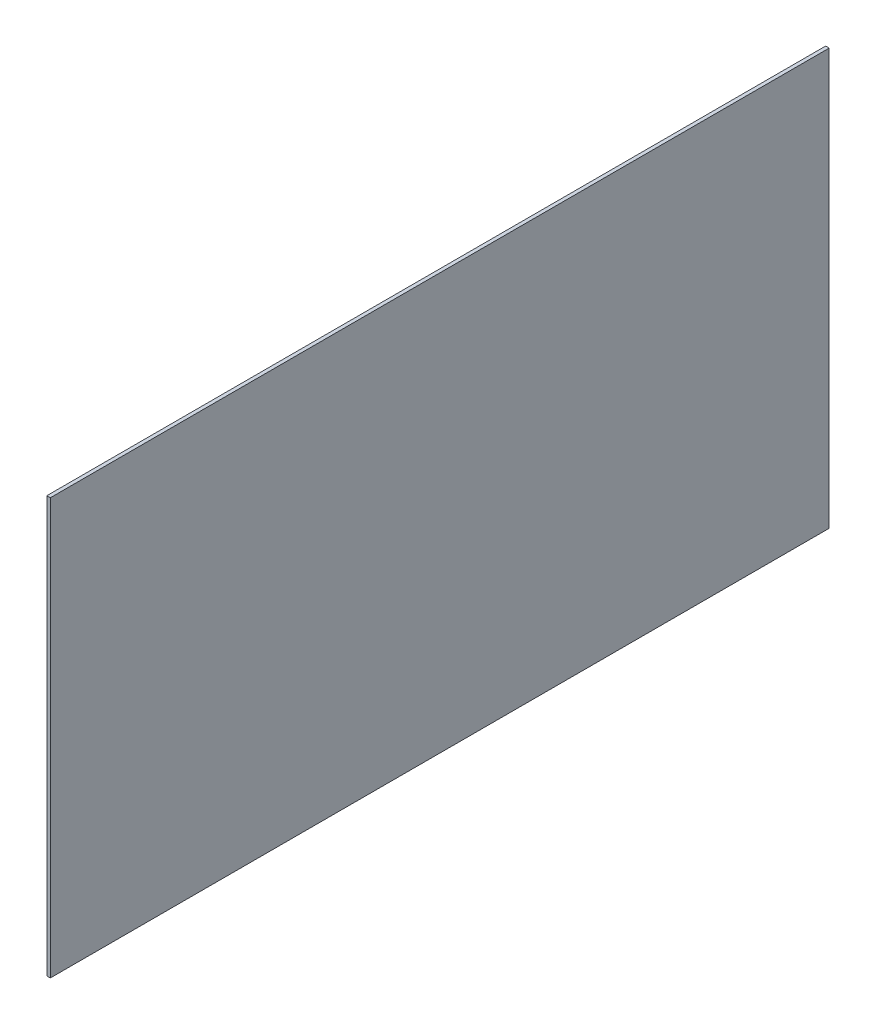
ISO-10303-21;
HEADER;
FILE_DESCRIPTION(('STEP AP214'),'2;1');
FILE_NAME('part.step','',(''),(''),'','','');
FILE_SCHEMA(('AUTOMOTIVE_DESIGN { 1 0 10303 214 1 1 1 1 }'));
ENDSEC;
DATA;
#1=APPLICATION_CONTEXT('core data for automotive mechanical design processes');
#2=APPLICATION_PROTOCOL_DEFINITION('international standard','automotive_design',2000,#1);
#3=PRODUCT_CONTEXT('',#1,'mechanical');
#4=PRODUCT('Part','Part','',(#3));
#5=PRODUCT_RELATED_PRODUCT_CATEGORY('part','',(#4));
#6=PRODUCT_DEFINITION_FORMATION('','',#4);
#7=PRODUCT_DEFINITION_CONTEXT('part definition',#1,'design');
#8=PRODUCT_DEFINITION('design','',#6,#7);
#9=PRODUCT_DEFINITION_SHAPE('','',#8);
#10=(LENGTH_UNIT() NAMED_UNIT(*) SI_UNIT(.MILLI.,.METRE.));
#11=(NAMED_UNIT(*) PLANE_ANGLE_UNIT() SI_UNIT($,.RADIAN.));
#12=(NAMED_UNIT(*) SI_UNIT($,.STERADIAN.) SOLID_ANGLE_UNIT());
#13=UNCERTAINTY_MEASURE_WITH_UNIT(LENGTH_MEASURE(1.E-05),#10,'distance_accuracy_value','');
#14=(GEOMETRIC_REPRESENTATION_CONTEXT(3) GLOBAL_UNCERTAINTY_ASSIGNED_CONTEXT((#13)) GLOBAL_UNIT_ASSIGNED_CONTEXT((#10,
#11,#12)) REPRESENTATION_CONTEXT('',''));
#15=CARTESIAN_POINT('',(0.,0.,0.));
#16=DIRECTION('',(0.,0.,1.));
#17=DIRECTION('',(1.,0.,0.));
#18=AXIS2_PLACEMENT_3D('',#15,#16,#17);
#19=CARTESIAN_POINT('',(-417.425,992.1,165.1));
#20=DIRECTION('',(-1.,0.,0.));
#21=DIRECTION('',(0.,0.,1.));
#22=AXIS2_PLACEMENT_3D('',#19,#20,#21);
#23=PLANE('',#22);
#24=DIRECTION('',(0.,1.,0.));
#25=VECTOR('',#24,1.);
#26=CARTESIAN_POINT('',(-417.425,992.1,-165.1));
#27=LINE('',#26,#25);
#28=CARTESIAN_POINT('',(-417.425,992.1,-165.1));
#29=VERTEX_POINT('',#28);
#30=CARTESIAN_POINT('',(-417.425,1168.4,-165.1));
#31=VERTEX_POINT('',#30);
#32=EDGE_CURVE('E98',#29,#31,#27,.T.);
#33=ORIENTED_EDGE('',*,*,#32,.T.);
#34=DIRECTION('',(0.,0.,-1.));
#35=VECTOR('',#34,1.);
#36=CARTESIAN_POINT('',(-417.425,1168.4,165.1));
#37=LINE('',#36,#35);
#38=CARTESIAN_POINT('',(-417.425,1168.4,165.1));
#39=VERTEX_POINT('',#38);
#40=EDGE_CURVE('E11',#39,#31,#37,.T.);
#41=ORIENTED_EDGE('',*,*,#40,.F.);
#42=DIRECTION('',(0.,1.,0.));
#43=VECTOR('',#42,1.);
#44=CARTESIAN_POINT('',(-417.425,992.1,165.1));
#45=LINE('',#44,#43);
#46=CARTESIAN_POINT('',(-417.425,992.1,165.1));
#47=VERTEX_POINT('',#46);
#48=EDGE_CURVE('E75',#47,#39,#45,.T.);
#49=ORIENTED_EDGE('',*,*,#48,.F.);
#50=DIRECTION('',(0.,0.,-1.));
#51=VECTOR('',#50,1.);
#52=CARTESIAN_POINT('',(-417.425,992.1,165.1));
#53=LINE('',#52,#51);
#54=EDGE_CURVE('E51',#47,#29,#53,.T.);
#55=ORIENTED_EDGE('',*,*,#54,.T.);
#56=EDGE_LOOP('',(#33,#41,#49,#55));
#57=FACE_BOUND('',#56,.T.);
#58=ADVANCED_FACE('F35',(#57),#23,.F.);
#59=CARTESIAN_POINT('',(-418.925,1168.4,165.1));
#60=DIRECTION('',(0.,1.,0.));
#61=DIRECTION('',(0.,0.,1.));
#62=AXIS2_PLACEMENT_3D('',#59,#60,#61);
#63=PLANE('',#62);
#64=DIRECTION('',(1.,0.,0.));
#65=VECTOR('',#64,1.);
#66=CARTESIAN_POINT('',(-418.925,1168.4,-165.1));
#67=LINE('',#66,#65);
#68=CARTESIAN_POINT('',(-418.925,1168.4,-165.1));
#69=VERTEX_POINT('',#68);
#70=EDGE_CURVE('E84',#69,#31,#67,.T.);
#71=ORIENTED_EDGE('',*,*,#70,.F.);
#72=DIRECTION('',(0.,0.,-1.));
#73=VECTOR('',#72,1.);
#74=CARTESIAN_POINT('',(-418.925,1168.4,165.1));
#75=LINE('',#74,#73);
#76=CARTESIAN_POINT('',(-418.925,1168.4,165.1));
#77=VERTEX_POINT('',#76);
#78=EDGE_CURVE('E43',#77,#69,#75,.T.);
#79=ORIENTED_EDGE('',*,*,#78,.F.);
#80=DIRECTION('',(1.,0.,0.));
#81=VECTOR('',#80,1.);
#82=CARTESIAN_POINT('',(-418.925,1168.4,165.1));
#83=LINE('',#82,#81);
#84=EDGE_CURVE('E82',#77,#39,#83,.T.);
#85=ORIENTED_EDGE('',*,*,#84,.T.);
#86=ORIENTED_EDGE('',*,*,#40,.T.);
#87=EDGE_LOOP('',(#71,#79,#85,#86));
#88=FACE_BOUND('',#87,.T.);
#89=ADVANCED_FACE('F81',(#88),#63,.T.);
#90=CARTESIAN_POINT('',(-418.925,992.1,165.1));
#91=DIRECTION('',(-1.,0.,0.));
#92=DIRECTION('',(0.,0.,1.));
#93=AXIS2_PLACEMENT_3D('',#90,#91,#92);
#94=PLANE('',#93);
#95=DIRECTION('',(0.,1.,0.));
#96=VECTOR('',#95,1.);
#97=CARTESIAN_POINT('',(-418.925,992.1,-165.1));
#98=LINE('',#97,#96);
#99=CARTESIAN_POINT('',(-418.925,992.1,-165.1));
#100=VERTEX_POINT('',#99);
#101=EDGE_CURVE('E101',#100,#69,#98,.T.);
#102=ORIENTED_EDGE('',*,*,#101,.F.);
#103=DIRECTION('',(0.,0.,-1.));
#104=VECTOR('',#103,1.);
#105=CARTESIAN_POINT('',(-418.925,992.1,165.1));
#106=LINE('',#105,#104);
#107=CARTESIAN_POINT('',(-418.925,992.1,165.1));
#108=VERTEX_POINT('',#107);
#109=EDGE_CURVE('E64',#108,#100,#106,.T.);
#110=ORIENTED_EDGE('',*,*,#109,.F.);
#111=DIRECTION('',(0.,1.,0.));
#112=VECTOR('',#111,1.);
#113=CARTESIAN_POINT('',(-418.925,992.1,165.1));
#114=LINE('',#113,#112);
#115=EDGE_CURVE('E90',#108,#77,#114,.T.);
#116=ORIENTED_EDGE('',*,*,#115,.T.);
#117=ORIENTED_EDGE('',*,*,#78,.T.);
#118=EDGE_LOOP('',(#102,#110,#116,#117));
#119=FACE_BOUND('',#118,.T.);
#120=ADVANCED_FACE('F92',(#119),#94,.T.);
#121=CARTESIAN_POINT('',(-417.425,992.1,165.1));
#122=DIRECTION('',(0.,-1.,0.));
#123=DIRECTION('',(0.,0.,-1.));
#124=AXIS2_PLACEMENT_3D('',#121,#122,#123);
#125=PLANE('',#124);
#126=DIRECTION('',(-1.,0.,0.));
#127=VECTOR('',#126,1.);
#128=CARTESIAN_POINT('',(-417.425,992.1,-165.1));
#129=LINE('',#128,#127);
#130=EDGE_CURVE('E103',#29,#100,#129,.T.);
#131=ORIENTED_EDGE('',*,*,#130,.F.);
#132=ORIENTED_EDGE('',*,*,#54,.F.);
#133=DIRECTION('',(-1.,0.,0.));
#134=VECTOR('',#133,1.);
#135=CARTESIAN_POINT('',(-417.425,992.1,165.1));
#136=LINE('',#135,#134);
#137=EDGE_CURVE('E93',#47,#108,#136,.T.);
#138=ORIENTED_EDGE('',*,*,#137,.T.);
#139=ORIENTED_EDGE('',*,*,#109,.T.);
#140=EDGE_LOOP('',(#131,#132,#138,#139));
#141=FACE_BOUND('',#140,.T.);
#142=ADVANCED_FACE('F109',(#141),#125,.T.);
#143=CARTESIAN_POINT('',(-417.425,1168.4,165.1));
#144=DIRECTION('',(0.,0.,-1.));
#145=DIRECTION('',(-1.,0.,0.));
#146=AXIS2_PLACEMENT_3D('',#143,#144,#145);
#147=PLANE('',#146);
#148=ORIENTED_EDGE('',*,*,#48,.T.);
#149=ORIENTED_EDGE('',*,*,#84,.F.);
#150=ORIENTED_EDGE('',*,*,#115,.F.);
#151=ORIENTED_EDGE('',*,*,#137,.F.);
#152=EDGE_LOOP('',(#148,#149,#150,#151));
#153=FACE_BOUND('',#152,.T.);
#154=ADVANCED_FACE('F89',(#153),#147,.F.);
#155=CARTESIAN_POINT('',(-417.425,1168.4,-165.1));
#156=DIRECTION('',(0.,0.,-1.));
#157=DIRECTION('',(-1.,0.,0.));
#158=AXIS2_PLACEMENT_3D('',#155,#156,#157);
#159=PLANE('',#158);
#160=ORIENTED_EDGE('',*,*,#32,.F.);
#161=ORIENTED_EDGE('',*,*,#130,.T.);
#162=ORIENTED_EDGE('',*,*,#101,.T.);
#163=ORIENTED_EDGE('',*,*,#70,.T.);
#164=EDGE_LOOP('',(#160,#161,#162,#163));
#165=FACE_BOUND('',#164,.T.);
#166=ADVANCED_FACE('F108',(#165),#159,.T.);
#167=CLOSED_SHELL('',(#58,#89,#120,#142,#154,#166));
#168=MANIFOLD_SOLID_BREP('B2',#167);
#169=ADVANCED_BREP_SHAPE_REPRESENTATION('',(#18,#168),#14);
#170=SHAPE_DEFINITION_REPRESENTATION(#9,#169);
ENDSEC;
END-ISO-10303-21;
